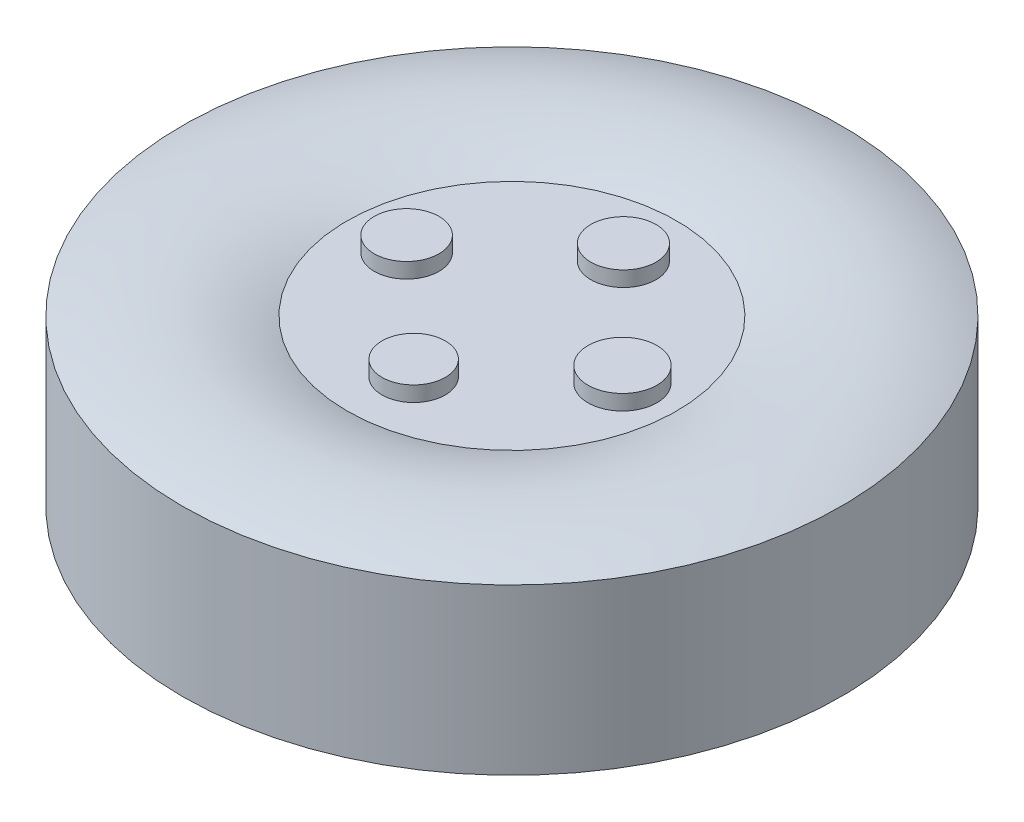
ISO-10303-21;
HEADER;
FILE_DESCRIPTION(('STEP AP214'),'2;1');
FILE_NAME('part.step','',(''),(''),'','','');
FILE_SCHEMA(('AUTOMOTIVE_DESIGN { 1 0 10303 214 1 1 1 1 }'));
ENDSEC;
DATA;
#1=APPLICATION_CONTEXT('core data for automotive mechanical design processes');
#2=APPLICATION_PROTOCOL_DEFINITION('international standard','automotive_design',2000,#1);
#3=PRODUCT_CONTEXT('',#1,'mechanical');
#4=PRODUCT('Part','Part','',(#3));
#5=PRODUCT_RELATED_PRODUCT_CATEGORY('part','',(#4));
#6=PRODUCT_DEFINITION_FORMATION('','',#4);
#7=PRODUCT_DEFINITION_CONTEXT('part definition',#1,'design');
#8=PRODUCT_DEFINITION('design','',#6,#7);
#9=PRODUCT_DEFINITION_SHAPE('','',#8);
#10=(LENGTH_UNIT() NAMED_UNIT(*) SI_UNIT(.MILLI.,.METRE.));
#11=(NAMED_UNIT(*) PLANE_ANGLE_UNIT() SI_UNIT($,.RADIAN.));
#12=(NAMED_UNIT(*) SI_UNIT($,.STERADIAN.) SOLID_ANGLE_UNIT());
#13=UNCERTAINTY_MEASURE_WITH_UNIT(LENGTH_MEASURE(1.E-05),#10,'distance_accuracy_value','');
#14=(GEOMETRIC_REPRESENTATION_CONTEXT(3) GLOBAL_UNCERTAINTY_ASSIGNED_CONTEXT((#13)) GLOBAL_UNIT_ASSIGNED_CONTEXT((#10,
#11,#12)) REPRESENTATION_CONTEXT('',''));
#15=CARTESIAN_POINT('',(0.,0.,0.));
#16=DIRECTION('',(0.,0.,1.));
#17=DIRECTION('',(1.,0.,0.));
#18=AXIS2_PLACEMENT_3D('',#15,#16,#17);
#19=CARTESIAN_POINT('',(-77.8626682440414,19.8872424067956,0.));
#20=DIRECTION('',(0.,1.,0.));
#21=DIRECTION('',(0.,0.,1.));
#22=AXIS2_PLACEMENT_3D('',#19,#20,#21);
#23=PLANE('',#22);
#24=CARTESIAN_POINT('',(-78.1885093529588,19.8872424067956,-0.00638628080690358));
#25=DIRECTION('',(0.,1.,0.));
#26=DIRECTION('',(0.,0.,1.));
#27=AXIS2_PLACEMENT_3D('',#24,#25,#26);
#28=CIRCLE('',#27,0.0982843337422546);
#29=CARTESIAN_POINT('',(-78.1885093529588,19.8872424067956,0.0918980529353511));
#30=VERTEX_POINT('',#29);
#31=EDGE_CURVE('E10',#30,#30,#28,.F.);
#32=ORIENTED_EDGE('',*,*,#31,.F.);
#33=EDGE_LOOP('',(#32));
#34=FACE_BOUND('',#33,.T.);
#35=CARTESIAN_POINT('',(-77.8518701504638,19.8872424067956,0.308843624500235));
#36=DIRECTION('',(0.,1.,0.));
#37=DIRECTION('',(0.,0.,1.));
#38=AXIS2_PLACEMENT_3D('',#35,#36,#37);
#39=CIRCLE('',#38,0.0959920180729392);
#40=CARTESIAN_POINT('',(-77.8518701504638,19.8872424067956,0.404835642573175));
#41=VERTEX_POINT('',#40);
#42=EDGE_CURVE('E48',#41,#41,#39,.F.);
#43=ORIENTED_EDGE('',*,*,#42,.F.);
#44=EDGE_LOOP('',(#43));
#45=FACE_BOUND('',#44,.T.);
#46=CARTESIAN_POINT('',(-77.5187776364073,19.8872424067956,0.00850890564028934));
#47=DIRECTION('',(0.,1.,0.));
#48=DIRECTION('',(0.,0.,1.));
#49=AXIS2_PLACEMENT_3D('',#46,#47,#48);
#50=CIRCLE('',#49,0.104475871100707);
#51=CARTESIAN_POINT('',(-77.5187776364073,19.8872424067956,0.112984776740996));
#52=VERTEX_POINT('',#51);
#53=EDGE_CURVE('E69',#52,#52,#50,.F.);
#54=ORIENTED_EDGE('',*,*,#53,.F.);
#55=EDGE_LOOP('',(#54));
#56=FACE_BOUND('',#55,.T.);
#57=CARTESIAN_POINT('',(-77.8380235176428,19.8872424067956,-0.313742014192183));
#58=DIRECTION('',(0.,1.,0.));
#59=DIRECTION('',(0.,0.,1.));
#60=AXIS2_PLACEMENT_3D('',#57,#58,#59);
#61=CIRCLE('',#60,0.0989843018319734);
#62=CARTESIAN_POINT('',(-77.8380235176428,19.8872424067956,-0.21475771236021));
#63=VERTEX_POINT('',#62);
#64=EDGE_CURVE('E79',#63,#63,#61,.F.);
#65=ORIENTED_EDGE('',*,*,#64,.F.);
#66=EDGE_LOOP('',(#65));
#67=FACE_BOUND('',#66,.T.);
#68=CARTESIAN_POINT('',(-77.8626682440414,19.8872424067956,0.));
#69=DIRECTION('',(0.,1.,0.));
#70=DIRECTION('',(0.,0.,1.));
#71=AXIS2_PLACEMENT_3D('',#68,#69,#70);
#72=CIRCLE('',#71,0.5);
#73=CARTESIAN_POINT('',(-77.8626682440414,19.8872424067956,0.5));
#74=VERTEX_POINT('',#73);
#75=EDGE_CURVE('E91',#74,#74,#72,.T.);
#76=ORIENTED_EDGE('',*,*,#75,.F.);
#77=EDGE_LOOP('',(#76));
#78=FACE_BOUND('',#77,.T.);
#79=ADVANCED_FACE('F37',(#34,#45,#56,#67,#78),#23,.F.);
#80=CARTESIAN_POINT('',(-77.8626682440414,20.5410772483267,0.));
#81=DIRECTION('',(0.,1.,0.));
#82=DIRECTION('',(0.,0.,1.));
#83=AXIS2_PLACEMENT_3D('',#80,#81,#82);
#84=TOROIDAL_SURFACE('',#83,0.750000000000001,0.7);
#85=CARTESIAN_POINT('',(-77.8626682440414,19.8872424067956,0.));
#86=DIRECTION('',(0.,1.,0.));
#87=DIRECTION('',(0.,0.,1.));
#88=AXIS2_PLACEMENT_3D('',#85,#86,#87);
#89=CIRCLE('',#88,1.);
#90=CARTESIAN_POINT('',(-77.8626682440414,19.8872424067956,1.));
#91=VERTEX_POINT('',#90);
#92=EDGE_CURVE('E88',#91,#91,#89,.T.);
#93=ORIENTED_EDGE('',*,*,#92,.F.);
#94=EDGE_LOOP('',(#93));
#95=FACE_BOUND('',#94,.T.);
#96=ORIENTED_EDGE('',*,*,#75,.T.);
#97=EDGE_LOOP('',(#96));
#98=FACE_BOUND('',#97,.T.);
#99=ADVANCED_FACE('F123',(#95,#98),#84,.T.);
#100=CARTESIAN_POINT('',(-77.8626682440414,20.3872424067956,0.));
#101=DIRECTION('',(0.,1.,0.));
#102=DIRECTION('',(0.,0.,1.));
#103=AXIS2_PLACEMENT_3D('',#100,#101,#102);
#104=CYLINDRICAL_SURFACE('',#103,1.);
#105=CARTESIAN_POINT('',(-77.8626682440414,20.3872424067956,0.));
#106=DIRECTION('',(0.,1.,0.));
#107=DIRECTION('',(0.,0.,1.));
#108=AXIS2_PLACEMENT_3D('',#105,#106,#107);
#109=CIRCLE('',#108,1.);
#110=CARTESIAN_POINT('',(-77.8626682440414,20.3872424067956,1.));
#111=VERTEX_POINT('',#110);
#112=EDGE_CURVE('E85',#111,#111,#109,.T.);
#113=ORIENTED_EDGE('',*,*,#112,.F.);
#114=EDGE_LOOP('',(#113));
#115=FACE_BOUND('',#114,.T.);
#116=ORIENTED_EDGE('',*,*,#92,.T.);
#117=EDGE_LOOP('',(#116));
#118=FACE_BOUND('',#117,.T.);
#119=ADVANCED_FACE('F117',(#115,#118),#104,.T.);
#120=CARTESIAN_POINT('',(-77.8626682440414,19.7353535937543,0.));
#121=DIRECTION('',(0.,1.,0.));
#122=DIRECTION('',(0.,0.,1.));
#123=AXIS2_PLACEMENT_3D('',#120,#121,#122);
#124=TOROIDAL_SURFACE('',#123,0.750000000000001,0.698182658455762);
#125=CARTESIAN_POINT('',(-77.8626682440414,20.3872424067956,0.));
#126=DIRECTION('',(0.,1.,0.));
#127=DIRECTION('',(0.,0.,1.));
#128=AXIS2_PLACEMENT_3D('',#125,#126,#127);
#129=CIRCLE('',#128,0.5);
#130=CARTESIAN_POINT('',(-77.8626682440414,20.3872424067956,0.5));
#131=VERTEX_POINT('',#130);
#132=EDGE_CURVE('E78',#131,#131,#129,.T.);
#133=ORIENTED_EDGE('',*,*,#132,.F.);
#134=EDGE_LOOP('',(#133));
#135=FACE_BOUND('',#134,.T.);
#136=ORIENTED_EDGE('',*,*,#112,.T.);
#137=EDGE_LOOP('',(#136));
#138=FACE_BOUND('',#137,.T.);
#139=ADVANCED_FACE('F106',(#135,#138),#124,.T.);
#140=CARTESIAN_POINT('',(-77.8626682440414,20.3872424067956,0.));
#141=DIRECTION('',(0.,-1.,0.));
#142=DIRECTION('',(0.,0.,-1.));
#143=AXIS2_PLACEMENT_3D('',#140,#141,#142);
#144=PLANE('',#143);
#145=CARTESIAN_POINT('',(-78.1885093529588,20.3872424067956,-0.00638628080690358));
#146=DIRECTION('',(0.,-1.,0.));
#147=DIRECTION('',(0.,0.,-1.));
#148=AXIS2_PLACEMENT_3D('',#145,#146,#147);
#149=CIRCLE('',#148,0.0982843337422546);
#150=CARTESIAN_POINT('',(-78.1885093529588,20.3872424067956,-0.104670614549158));
#151=VERTEX_POINT('',#150);
#152=EDGE_CURVE('E40',#151,#151,#149,.F.);
#153=ORIENTED_EDGE('',*,*,#152,.F.);
#154=EDGE_LOOP('',(#153));
#155=FACE_BOUND('',#154,.T.);
#156=CARTESIAN_POINT('',(-77.8518701504638,20.3872424067956,0.308843624500235));
#157=DIRECTION('',(0.,-1.,0.));
#158=DIRECTION('',(0.,0.,-1.));
#159=AXIS2_PLACEMENT_3D('',#156,#157,#158);
#160=CIRCLE('',#159,0.0959920180729392);
#161=CARTESIAN_POINT('',(-77.8518701504638,20.3872424067956,0.212851606427296));
#162=VERTEX_POINT('',#161);
#163=EDGE_CURVE('E62',#162,#162,#160,.F.);
#164=ORIENTED_EDGE('',*,*,#163,.F.);
#165=EDGE_LOOP('',(#164));
#166=FACE_BOUND('',#165,.T.);
#167=CARTESIAN_POINT('',(-77.5187776364073,20.3872424067956,0.00850890564028934));
#168=DIRECTION('',(0.,-1.,0.));
#169=DIRECTION('',(0.,0.,-1.));
#170=AXIS2_PLACEMENT_3D('',#167,#168,#169);
#171=CIRCLE('',#170,0.104475871100707);
#172=CARTESIAN_POINT('',(-77.5187776364073,20.3872424067956,-0.0959669654604172));
#173=VERTEX_POINT('',#172);
#174=EDGE_CURVE('E72',#173,#173,#171,.F.);
#175=ORIENTED_EDGE('',*,*,#174,.F.);
#176=EDGE_LOOP('',(#175));
#177=FACE_BOUND('',#176,.T.);
#178=CARTESIAN_POINT('',(-77.8380235176428,20.3872424067956,-0.313742014192183));
#179=DIRECTION('',(0.,-1.,0.));
#180=DIRECTION('',(0.,0.,-1.));
#181=AXIS2_PLACEMENT_3D('',#178,#179,#180);
#182=CIRCLE('',#181,0.0989843018319734);
#183=CARTESIAN_POINT('',(-77.8380235176428,20.3872424067956,-0.412726316024157));
#184=VERTEX_POINT('',#183);
#185=EDGE_CURVE('E82',#184,#184,#182,.F.);
#186=ORIENTED_EDGE('',*,*,#185,.F.);
#187=EDGE_LOOP('',(#186));
#188=FACE_BOUND('',#187,.T.);
#189=ORIENTED_EDGE('',*,*,#132,.T.);
#190=EDGE_LOOP('',(#189));
#191=FACE_BOUND('',#190,.T.);
#192=ADVANCED_FACE('F102',(#155,#166,#177,#188,#191),#144,.F.);
#193=CARTESIAN_POINT('',(-77.8380235176428,20.4335362522101,-0.313742014192183));
#194=DIRECTION('',(0.,1.,0.));
#195=DIRECTION('',(0.,0.,1.));
#196=AXIS2_PLACEMENT_3D('',#193,#194,#195);
#197=PLANE('',#196);
#198=CARTESIAN_POINT('',(-77.8380235176428,20.4335362522101,-0.313742014192183));
#199=DIRECTION('',(0.,1.,0.));
#200=DIRECTION('',(0.,0.,1.));
#201=AXIS2_PLACEMENT_3D('',#198,#199,#200);
#202=CIRCLE('',#201,0.0989843018319734);
#203=CARTESIAN_POINT('',(-77.8380235176428,20.4335362522101,-0.21475771236021));
#204=VERTEX_POINT('',#203);
#205=EDGE_CURVE('E75',#204,#204,#202,.T.);
#206=ORIENTED_EDGE('',*,*,#205,.T.);
#207=EDGE_LOOP('',(#206));
#208=FACE_BOUND('',#207,.T.);
#209=ADVANCED_FACE('F105',(#208),#197,.T.);
#210=CARTESIAN_POINT('',(-77.8380235176428,20.4335362522101,-0.313742014192183));
#211=DIRECTION('',(0.,-1.,0.));
#212=DIRECTION('',(0.,0.,-1.));
#213=AXIS2_PLACEMENT_3D('',#210,#211,#212);
#214=CYLINDRICAL_SURFACE('',#213,0.0989843018319734);
#215=ORIENTED_EDGE('',*,*,#205,.F.);
#216=EDGE_LOOP('',(#215));
#217=FACE_BOUND('',#216,.T.);
#218=ORIENTED_EDGE('',*,*,#185,.T.);
#219=EDGE_LOOP('',(#218));
#220=FACE_BOUND('',#219,.T.);
#221=ADVANCED_FACE('F145',(#217,#220),#214,.T.);
#222=CARTESIAN_POINT('',(-77.8380235176428,19.8410772483267,-0.313742014192183));
#223=DIRECTION('',(0.,1.,0.));
#224=DIRECTION('',(0.,0.,1.));
#225=AXIS2_PLACEMENT_3D('',#222,#223,#224);
#226=CIRCLE('',#225,0.0989843018319734);
#227=CARTESIAN_POINT('',(-77.8380235176428,19.8410772483267,-0.21475771236021));
#228=VERTEX_POINT('',#227);
#229=EDGE_CURVE('E68',#228,#228,#226,.T.);
#230=ORIENTED_EDGE('',*,*,#229,.T.);
#231=EDGE_LOOP('',(#230));
#232=FACE_BOUND('',#231,.T.);
#233=ORIENTED_EDGE('',*,*,#64,.T.);
#234=EDGE_LOOP('',(#233));
#235=FACE_BOUND('',#234,.T.);
#236=ADVANCED_FACE('F142',(#232,#235),#214,.T.);
#237=CARTESIAN_POINT('',(-77.8380235176428,19.8410772483267,-0.313742014192183));
#238=DIRECTION('',(0.,1.,0.));
#239=DIRECTION('',(0.,0.,1.));
#240=AXIS2_PLACEMENT_3D('',#237,#238,#239);
#241=PLANE('',#240);
#242=ORIENTED_EDGE('',*,*,#229,.F.);
#243=EDGE_LOOP('',(#242));
#244=FACE_BOUND('',#243,.T.);
#245=ADVANCED_FACE('F144',(#244),#241,.F.);
#246=CARTESIAN_POINT('',(-77.5187776364073,20.4335362522101,0.00850890564028934));
#247=DIRECTION('',(0.,1.,0.));
#248=DIRECTION('',(0.,0.,1.));
#249=AXIS2_PLACEMENT_3D('',#246,#247,#248);
#250=PLANE('',#249);
#251=CARTESIAN_POINT('',(-77.5187776364073,20.4335362522101,0.00850890564028934));
#252=DIRECTION('',(0.,1.,0.));
#253=DIRECTION('',(0.,0.,1.));
#254=AXIS2_PLACEMENT_3D('',#251,#252,#253);
#255=CIRCLE('',#254,0.104475871100707);
#256=CARTESIAN_POINT('',(-77.5187776364073,20.4335362522101,0.112984776740996));
#257=VERTEX_POINT('',#256);
#258=EDGE_CURVE('E65',#257,#257,#255,.T.);
#259=ORIENTED_EDGE('',*,*,#258,.T.);
#260=EDGE_LOOP('',(#259));
#261=FACE_BOUND('',#260,.T.);
#262=ADVANCED_FACE('F152',(#261),#250,.T.);
#263=CARTESIAN_POINT('',(-77.5187776364073,20.4335362522101,0.00850890564028934));
#264=DIRECTION('',(0.,-1.,0.));
#265=DIRECTION('',(0.,0.,-1.));
#266=AXIS2_PLACEMENT_3D('',#263,#264,#265);
#267=CYLINDRICAL_SURFACE('',#266,0.104475871100707);
#268=ORIENTED_EDGE('',*,*,#258,.F.);
#269=EDGE_LOOP('',(#268));
#270=FACE_BOUND('',#269,.T.);
#271=ORIENTED_EDGE('',*,*,#174,.T.);
#272=EDGE_LOOP('',(#271));
#273=FACE_BOUND('',#272,.T.);
#274=ADVANCED_FACE('F164',(#270,#273),#267,.T.);
#275=CARTESIAN_POINT('',(-77.5187776364073,19.8410772483267,0.00850890564028934));
#276=DIRECTION('',(0.,1.,0.));
#277=DIRECTION('',(0.,0.,1.));
#278=AXIS2_PLACEMENT_3D('',#275,#276,#277);
#279=CIRCLE('',#278,0.104475871100707);
#280=CARTESIAN_POINT('',(-77.5187776364073,19.8410772483267,0.112984776740996));
#281=VERTEX_POINT('',#280);
#282=EDGE_CURVE('E59',#281,#281,#279,.T.);
#283=ORIENTED_EDGE('',*,*,#282,.T.);
#284=EDGE_LOOP('',(#283));
#285=FACE_BOUND('',#284,.T.);
#286=ORIENTED_EDGE('',*,*,#53,.T.);
#287=EDGE_LOOP('',(#286));
#288=FACE_BOUND('',#287,.T.);
#289=ADVANCED_FACE('F160',(#285,#288),#267,.T.);
#290=CARTESIAN_POINT('',(-77.5187776364073,19.8410772483267,0.00850890564028934));
#291=DIRECTION('',(0.,1.,0.));
#292=DIRECTION('',(0.,0.,1.));
#293=AXIS2_PLACEMENT_3D('',#290,#291,#292);
#294=PLANE('',#293);
#295=ORIENTED_EDGE('',*,*,#282,.F.);
#296=EDGE_LOOP('',(#295));
#297=FACE_BOUND('',#296,.T.);
#298=ADVANCED_FACE('F163',(#297),#294,.F.);
#299=CARTESIAN_POINT('',(-77.8518701504638,20.4335362522101,0.308843624500235));
#300=DIRECTION('',(0.,1.,0.));
#301=DIRECTION('',(0.,0.,1.));
#302=AXIS2_PLACEMENT_3D('',#299,#300,#301);
#303=PLANE('',#302);
#304=CARTESIAN_POINT('',(-77.8518701504638,20.4335362522101,0.308843624500235));
#305=DIRECTION('',(0.,1.,0.));
#306=DIRECTION('',(0.,0.,1.));
#307=AXIS2_PLACEMENT_3D('',#304,#305,#306);
#308=CIRCLE('',#307,0.0959920180729392);
#309=CARTESIAN_POINT('',(-77.8518701504638,20.4335362522101,0.404835642573175));
#310=VERTEX_POINT('',#309);
#311=EDGE_CURVE('E56',#310,#310,#308,.T.);
#312=ORIENTED_EDGE('',*,*,#311,.T.);
#313=EDGE_LOOP('',(#312));
#314=FACE_BOUND('',#313,.T.);
#315=ADVANCED_FACE('F171',(#314),#303,.T.);
#316=CARTESIAN_POINT('',(-77.8518701504638,20.4335362522101,0.308843624500235));
#317=DIRECTION('',(0.,-1.,0.));
#318=DIRECTION('',(0.,0.,-1.));
#319=AXIS2_PLACEMENT_3D('',#316,#317,#318);
#320=CYLINDRICAL_SURFACE('',#319,0.0959920180729392);
#321=ORIENTED_EDGE('',*,*,#311,.F.);
#322=EDGE_LOOP('',(#321));
#323=FACE_BOUND('',#322,.T.);
#324=ORIENTED_EDGE('',*,*,#163,.T.);
#325=EDGE_LOOP('',(#324));
#326=FACE_BOUND('',#325,.T.);
#327=ADVANCED_FACE('F100',(#323,#326),#320,.T.);
#328=CARTESIAN_POINT('',(-77.8518701504638,19.8410772483267,0.308843624500235));
#329=DIRECTION('',(0.,1.,0.));
#330=DIRECTION('',(0.,0.,1.));
#331=AXIS2_PLACEMENT_3D('',#328,#329,#330);
#332=CIRCLE('',#331,0.0959920180729392);
#333=CARTESIAN_POINT('',(-77.8518701504638,19.8410772483267,0.404835642573175));
#334=VERTEX_POINT('',#333);
#335=EDGE_CURVE('E53',#334,#334,#332,.T.);
#336=ORIENTED_EDGE('',*,*,#335,.T.);
#337=EDGE_LOOP('',(#336));
#338=FACE_BOUND('',#337,.T.);
#339=ORIENTED_EDGE('',*,*,#42,.T.);
#340=EDGE_LOOP('',(#339));
#341=FACE_BOUND('',#340,.T.);
#342=ADVANCED_FACE('F173',(#338,#341),#320,.T.);
#343=CARTESIAN_POINT('',(-77.8518701504638,19.8410772483267,0.308843624500235));
#344=DIRECTION('',(0.,1.,0.));
#345=DIRECTION('',(0.,0.,1.));
#346=AXIS2_PLACEMENT_3D('',#343,#344,#345);
#347=PLANE('',#346);
#348=ORIENTED_EDGE('',*,*,#335,.F.);
#349=EDGE_LOOP('',(#348));
#350=FACE_BOUND('',#349,.T.);
#351=ADVANCED_FACE('F176',(#350),#347,.F.);
#352=CARTESIAN_POINT('',(-78.1885093529588,20.4335362522101,-0.00638628080690358));
#353=DIRECTION('',(0.,1.,0.));
#354=DIRECTION('',(0.,0.,1.));
#355=AXIS2_PLACEMENT_3D('',#352,#353,#354);
#356=PLANE('',#355);
#357=CARTESIAN_POINT('',(-78.1885093529588,20.4335362522101,-0.00638628080690358));
#358=DIRECTION('',(0.,1.,0.));
#359=DIRECTION('',(0.,0.,1.));
#360=AXIS2_PLACEMENT_3D('',#357,#358,#359);
#361=CIRCLE('',#360,0.0982843337422546);
#362=CARTESIAN_POINT('',(-78.1885093529588,20.4335362522101,0.0918980529353511));
#363=VERTEX_POINT('',#362);
#364=EDGE_CURVE('E51',#363,#363,#361,.T.);
#365=ORIENTED_EDGE('',*,*,#364,.T.);
#366=EDGE_LOOP('',(#365));
#367=FACE_BOUND('',#366,.T.);
#368=ADVANCED_FACE('F183',(#367),#356,.T.);
#369=CARTESIAN_POINT('',(-78.1885093529588,20.4335362522101,-0.00638628080690358));
#370=DIRECTION('',(0.,-1.,0.));
#371=DIRECTION('',(0.,0.,-1.));
#372=AXIS2_PLACEMENT_3D('',#369,#370,#371);
#373=CYLINDRICAL_SURFACE('',#372,0.0982843337422546);
#374=ORIENTED_EDGE('',*,*,#364,.F.);
#375=EDGE_LOOP('',(#374));
#376=FACE_BOUND('',#375,.T.);
#377=ORIENTED_EDGE('',*,*,#152,.T.);
#378=EDGE_LOOP('',(#377));
#379=FACE_BOUND('',#378,.T.);
#380=ADVANCED_FACE('F189',(#376,#379),#373,.T.);
#381=CARTESIAN_POINT('',(-78.1885093529588,19.8410772483267,-0.00638628080690358));
#382=DIRECTION('',(0.,1.,0.));
#383=DIRECTION('',(0.,0.,1.));
#384=AXIS2_PLACEMENT_3D('',#381,#382,#383);
#385=CIRCLE('',#384,0.0982843337422546);
#386=CARTESIAN_POINT('',(-78.1885093529588,19.8410772483267,0.0918980529353511));
#387=VERTEX_POINT('',#386);
#388=EDGE_CURVE('E200',#387,#387,#385,.T.);
#389=ORIENTED_EDGE('',*,*,#388,.T.);
#390=EDGE_LOOP('',(#389));
#391=FACE_BOUND('',#390,.T.);
#392=ORIENTED_EDGE('',*,*,#31,.T.);
#393=EDGE_LOOP('',(#392));
#394=FACE_BOUND('',#393,.T.);
#395=ADVANCED_FACE('F185',(#391,#394),#373,.T.);
#396=CARTESIAN_POINT('',(-78.1885093529588,19.8410772483267,-0.00638628080690358));
#397=DIRECTION('',(0.,1.,0.));
#398=DIRECTION('',(0.,0.,1.));
#399=AXIS2_PLACEMENT_3D('',#396,#397,#398);
#400=PLANE('',#399);
#401=ORIENTED_EDGE('',*,*,#388,.F.);
#402=EDGE_LOOP('',(#401));
#403=FACE_BOUND('',#402,.T.);
#404=ADVANCED_FACE('F188',(#403),#400,.F.);
#405=CLOSED_SHELL('',(#79,#99,#119,#139,#192,#209,#221,#236,#245,#262,#274,#289,#298,#315,#327,
#342,#351,#368,#380,#395,#404));
#406=MANIFOLD_SOLID_BREP('B2',#405);
#407=ADVANCED_BREP_SHAPE_REPRESENTATION('',(#18,#406),#14);
#408=SHAPE_DEFINITION_REPRESENTATION(#9,#407);
ENDSEC;
END-ISO-10303-21;
